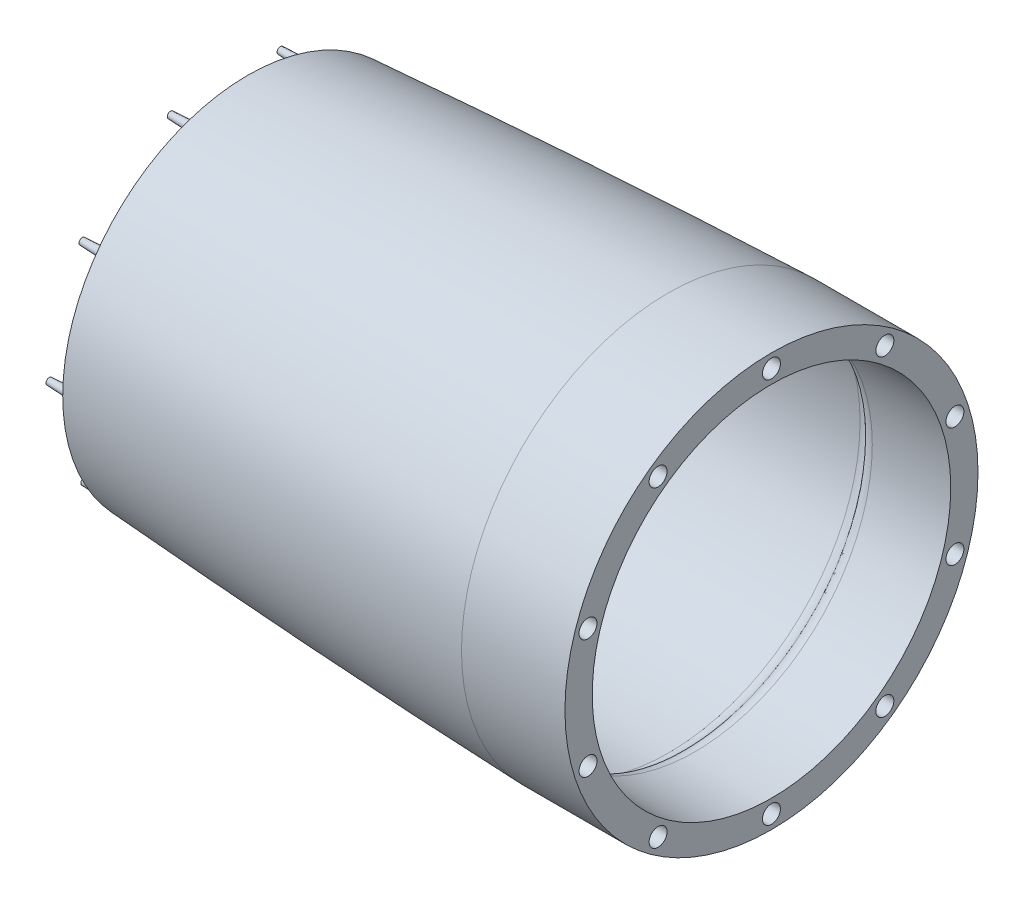
ISO-10303-21;
HEADER;
FILE_DESCRIPTION(('STEP AP214'),'2;1');
FILE_NAME('part.step','',(''),(''),'','','');
FILE_SCHEMA(('AUTOMOTIVE_DESIGN { 1 0 10303 214 1 1 1 1 }'));
ENDSEC;
DATA;
#1=APPLICATION_CONTEXT('core data for automotive mechanical design processes');
#2=APPLICATION_PROTOCOL_DEFINITION('international standard','automotive_design',2000,#1);
#3=PRODUCT_CONTEXT('',#1,'mechanical');
#4=PRODUCT('Part','Part','',(#3));
#5=PRODUCT_RELATED_PRODUCT_CATEGORY('part','',(#4));
#6=PRODUCT_DEFINITION_FORMATION('','',#4);
#7=PRODUCT_DEFINITION_CONTEXT('part definition',#1,'design');
#8=PRODUCT_DEFINITION('design','',#6,#7);
#9=PRODUCT_DEFINITION_SHAPE('','',#8);
#10=(LENGTH_UNIT() NAMED_UNIT(*) SI_UNIT(.MILLI.,.METRE.));
#11=(NAMED_UNIT(*) PLANE_ANGLE_UNIT() SI_UNIT($,.RADIAN.));
#12=(NAMED_UNIT(*) SI_UNIT($,.STERADIAN.) SOLID_ANGLE_UNIT());
#13=UNCERTAINTY_MEASURE_WITH_UNIT(LENGTH_MEASURE(1.E-05),#10,'distance_accuracy_value','');
#14=(GEOMETRIC_REPRESENTATION_CONTEXT(3) GLOBAL_UNCERTAINTY_ASSIGNED_CONTEXT((#13)) GLOBAL_UNIT_ASSIGNED_CONTEXT((#10,
#11,#12)) REPRESENTATION_CONTEXT('',''));
#15=CARTESIAN_POINT('',(0.,0.,0.));
#16=DIRECTION('',(0.,0.,1.));
#17=DIRECTION('',(1.,0.,0.));
#18=AXIS2_PLACEMENT_3D('',#15,#16,#17);
#19=CARTESIAN_POINT('',(0.,-76.2,0.));
#20=DIRECTION('',(1.,0.,0.));
#21=DIRECTION('',(0.,0.,-1.));
#22=AXIS2_PLACEMENT_3D('',#19,#20,#21);
#23=CYLINDRICAL_SURFACE('',#22,87.6605702842971);
#24=CARTESIAN_POINT('',(-259.812483714893,-76.2,0.));
#25=DIRECTION('',(1.,0.,0.));
#26=DIRECTION('',(0.,0.,-1.));
#27=AXIS2_PLACEMENT_3D('',#24,#25,#26);
#28=CIRCLE('',#27,87.6605702842971);
#29=CARTESIAN_POINT('',(-259.812483714893,-76.2,-87.6605702842971));
#30=VERTEX_POINT('',#29);
#31=EDGE_CURVE('E70',#30,#30,#28,.T.);
#32=ORIENTED_EDGE('',*,*,#31,.T.);
#33=EDGE_LOOP('',(#32));
#34=FACE_BOUND('',#33,.T.);
#35=CARTESIAN_POINT('',(-215.9,-76.2,0.));
#36=DIRECTION('',(1.,0.,0.));
#37=DIRECTION('',(0.,0.,-1.));
#38=AXIS2_PLACEMENT_3D('',#35,#36,#37);
#39=CIRCLE('',#38,87.6605702842971);
#40=CARTESIAN_POINT('',(-215.9,-76.2,-87.6605702842971));
#41=VERTEX_POINT('',#40);
#42=EDGE_CURVE('E79',#41,#41,#39,.T.);
#43=ORIENTED_EDGE('',*,*,#42,.F.);
#44=EDGE_LOOP('',(#43));
#45=FACE_BOUND('',#44,.T.);
#46=ADVANCED_FACE('F33',(#34,#45),#23,.T.);
#47=CARTESIAN_POINT('',(0.,0.,0.));
#48=CARTESIAN_POINT('',(-50.8,0.,0.));
#49=CARTESIAN_POINT('',(-101.6,0.,0.));
#50=CARTESIAN_POINT('',(-157.18237532759,0.,0.));
#51=CARTESIAN_POINT('',(-166.74712598277,0.,0.));
#52=CARTESIAN_POINT('',(-181.09425196554,0.,0.));
#53=CARTESIAN_POINT('',(-190.65900262072,0.,0.));
#54=CARTESIAN_POINT('',(-199.585120864969,0.,0.));
#55=CARTESIAN_POINT('',(-207.872606698287,0.,0.));
#56=CARTESIAN_POINT('',(-220.304800851467,-0.15495983877073,0.));
#57=CARTESIAN_POINT('',(-228.589711976257,-0.361524820706449,0.));
#58=CARTESIAN_POINT('',(-235.094659098791,-0.523710541786571,0.));
#59=CARTESIAN_POINT('',(-239.819642219067,-0.641517002011094,0.));
#60=CARTESIAN_POINT('',(-245.046645358789,-0.791480258471811,0.));
#61=CARTESIAN_POINT('',(-247.911294959409,-0.876040976098197,0.));
#62=CARTESIAN_POINT('',(-248.413737761523,-0.890953220604229,0.));
#63=B_SPLINE_CURVE_WITH_KNOTS('',3,(#47,#48,#49,#50,#51,#52,#53,#54,#55,#56,#57,#58,#59,#60,#61,
#62),.UNSPECIFIED.,.F.,.F.,(4,2,1,1,2,1,1,2,1,1,4),(0.761574076780111,0.907841521459126,
0.921611321039098,0.93538112061907,0.949150920199042,0.961081917990901,0.97301291578276,
0.98494391357462,0.991748303184292,0.998552692793965,1.),.UNSPECIFIED.);
#64=CARTESIAN_POINT('',(0.,-76.2,0.));
#65=DIRECTION('',(1.,0.,0.));
#66=AXIS1_PLACEMENT('',#64,#65);
#67=SURFACE_OF_REVOLUTION('',#63,#66);
#68=CARTESIAN_POINT('',(-248.413737761523,-76.2,0.));
#69=DIRECTION('',(1.,0.,0.));
#70=DIRECTION('',(0.,0.,-1.));
#71=AXIS2_PLACEMENT_3D('',#68,#69,#70);
#72=CIRCLE('',#71,75.3090467793958);
#73=CARTESIAN_POINT('',(-248.413737761523,-76.2,-75.3090467793958));
#74=VERTEX_POINT('',#73);
#75=EDGE_CURVE('E88',#74,#74,#72,.T.);
#76=ORIENTED_EDGE('',*,*,#75,.F.);
#77=EDGE_LOOP('',(#76));
#78=FACE_BOUND('',#77,.T.);
#79=CARTESIAN_POINT('',(-215.9,-76.2,0.));
#80=DIRECTION('',(1.,0.,0.));
#81=DIRECTION('',(0.,0.,-1.));
#82=AXIS2_PLACEMENT_3D('',#79,#80,#81);
#83=CIRCLE('',#82,76.091842302558);
#84=CARTESIAN_POINT('',(-215.9,-76.2,-76.091842302558));
#85=VERTEX_POINT('',#84);
#86=EDGE_CURVE('E76',#85,#85,#83,.F.);
#87=ORIENTED_EDGE('',*,*,#86,.F.);
#88=EDGE_LOOP('',(#87));
#89=FACE_BOUND('',#88,.T.);
#90=ADVANCED_FACE('F103',(#78,#89),#67,.T.);
#91=CARTESIAN_POINT('',(-259.812483714893,11.460570284297,0.));
#92=CARTESIAN_POINT('',(-287.312106379697,10.5623408515305,0.));
#93=CARTESIAN_POINT('',(-342.298022137353,8.17156900853598,0.));
#94=CARTESIAN_POINT('',(-452.140135715747,1.83352473554385,0.));
#95=CARTESIAN_POINT('',(-589.280273051557,-8.5121188078909,0.));
#96=CARTESIAN_POINT('',(-726.176632388446,-21.7709007537404,0.));
#97=CARTESIAN_POINT('',(-835.465785428388,-34.5887261399924,0.));
#98=CARTESIAN_POINT('',(-890.027026606975,-41.9652027624198,0.));
#99=CARTESIAN_POINT('',(-917.245364412614,-46.0396236215406,0.));
#100=B_SPLINE_CURVE_WITH_KNOTS('',3,(#91,#92,#93,#94,#95,#96,#97,#98,#99),.UNSPECIFIED.,.F.,.F.,
(4,1,1,1,1,1,4),(0.121539177885851,0.200323508121493,0.279107838357135,0.436676498828419,
0.594245159299703,0.673029489535345,0.751813819770986),.UNSPECIFIED.);
#101=CARTESIAN_POINT('',(0.,-76.2,0.));
#102=DIRECTION('',(1.,0.,0.));
#103=AXIS1_PLACEMENT('',#101,#102);
#104=SURFACE_OF_REVOLUTION('',#100,#103);
#105=CARTESIAN_POINT('',(-438.15,-76.2,0.));
#106=DIRECTION('',(1.,0.,0.));
#107=DIRECTION('',(0.,0.,-1.));
#108=AXIS2_PLACEMENT_3D('',#105,#106,#107);
#109=CIRCLE('',#108,78.5859575802931);
#110=CARTESIAN_POINT('',(-438.15,-76.2,-78.5859575802931));
#111=VERTEX_POINT('',#110);
#112=EDGE_CURVE('E74',#111,#111,#109,.F.);
#113=ORIENTED_EDGE('',*,*,#112,.F.);
#114=EDGE_LOOP('',(#113));
#115=FACE_BOUND('',#114,.T.);
#116=ORIENTED_EDGE('',*,*,#31,.F.);
#117=EDGE_LOOP('',(#116));
#118=FACE_BOUND('',#117,.T.);
#119=ADVANCED_FACE('F107',(#115,#118),#104,.F.);
#120=CARTESIAN_POINT('',(-259.605182082093,5.11395496327444,0.));
#121=CARTESIAN_POINT('',(-267.12768254606,4.86824499819252,0.));
#122=CARTESIAN_POINT('',(-283.426031509972,4.28566928092725,0.));
#123=CARTESIAN_POINT('',(-317.270262328934,2.88050564552106,0.));
#124=CARTESIAN_POINT('',(-361.130016616179,0.711244662128463,0.));
#125=CARTESIAN_POINT('',(-431.275457268552,-3.37195649395594,0.));
#126=CARTESIAN_POINT('',(-501.372917975129,-8.26687627302136,0.));
#127=CARTESIAN_POINT('',(-571.414486842692,-13.8916826479783,0.));
#128=CARTESIAN_POINT('',(-623.914744737059,-18.4776988889442,0.));
#129=CARTESIAN_POINT('',(-676.380314026956,-23.4393497952148,0.));
#130=CARTESIAN_POINT('',(-728.805663240347,-28.7990620723279,0.));
#131=CARTESIAN_POINT('',(-772.453634614019,-33.627485173269,0.));
#132=CARTESIAN_POINT('',(-807.341816529924,-37.7391545432386,0.));
#133=CARTESIAN_POINT('',(-833.490683910714,-40.9589001471484,0.));
#134=CARTESIAN_POINT('',(-859.619375691871,-44.3289411148186,0.));
#135=CARTESIAN_POINT('',(-885.723877264818,-47.8693351323976,0.));
#136=CARTESIAN_POINT('',(-904.61249297492,-50.577906922154,0.));
#137=CARTESIAN_POINT('',(-914.800968172167,-52.0944643953555,0.));
#138=CARTESIAN_POINT('',(-916.305282206307,-52.3196511250938,0.));
#139=B_SPLINE_CURVE_WITH_KNOTS('',3,(#120,#121,#122,#123,#124,#125,#126,#127,#128,#129,#130,
#131,#132,#133,#134,#135,#136,#137,#138),.UNSPECIFIED.,.F.,.F.,(4,1,1,1,1,1,1,1,1,1,1,1,1,1,1,1,
4),(0.121539177885851,0.143122913317239,0.168303261053087,0.218663956524784,0.26902465199648,
0.369746042939873,0.420106738411569,0.470467433883266,0.520828129354962,0.571188824826659,
0.621549520298355,0.646729868034203,0.671910215770052,0.6970905635059,0.722270911241748,
0.747451258977596,0.751813819770986),.UNSPECIFIED.);
#140=CARTESIAN_POINT('',(0.,-76.2,0.));
#141=DIRECTION('',(1.,0.,0.));
#142=AXIS1_PLACEMENT('',#140,#141);
#143=SURFACE_OF_REVOLUTION('',#139,#142);
#144=CARTESIAN_POINT('',(-438.15,-76.2,0.));
#145=DIRECTION('',(1.,0.,0.));
#146=DIRECTION('',(0.,0.,-1.));
#147=AXIS2_PLACEMENT_3D('',#144,#145,#146);
#148=CIRCLE('',#147,72.2219194807445);
#149=CARTESIAN_POINT('',(-438.15,-76.2,-72.2219194807445));
#150=VERTEX_POINT('',#149);
#151=EDGE_CURVE('E71',#150,#150,#148,.F.);
#152=ORIENTED_EDGE('',*,*,#151,.T.);
#153=EDGE_LOOP('',(#152));
#154=FACE_BOUND('',#153,.T.);
#155=CARTESIAN_POINT('',(-259.605182082093,-76.2,0.));
#156=DIRECTION('',(1.,0.,0.));
#157=DIRECTION('',(0.,0.,-1.));
#158=AXIS2_PLACEMENT_3D('',#155,#156,#157);
#159=CIRCLE('',#158,81.3139549632744);
#160=CARTESIAN_POINT('',(-259.605182082093,-76.2,-81.3139549632744));
#161=VERTEX_POINT('',#160);
#162=EDGE_CURVE('E82',#161,#161,#159,.T.);
#163=ORIENTED_EDGE('',*,*,#162,.T.);
#164=EDGE_LOOP('',(#163));
#165=FACE_BOUND('',#164,.T.);
#166=ADVANCED_FACE('F118',(#154,#165),#143,.T.);
#167=CARTESIAN_POINT('',(-259.397880449279,-76.2,0.));
#168=DIRECTION('',(1.,0.,0.));
#169=DIRECTION('',(0.,0.,-1.));
#170=AXIS2_PLACEMENT_3D('',#167,#168,#169);
#171=TOROIDAL_SURFACE('',#170,74.9673396422523,6.35000000000002);
#172=ORIENTED_EDGE('',*,*,#162,.F.);
#173=EDGE_LOOP('',(#172));
#174=FACE_BOUND('',#173,.T.);
#175=CARTESIAN_POINT('',(-254.,-76.2,0.));
#176=DIRECTION('',(1.,0.,0.));
#177=DIRECTION('',(0.,0.,-1.));
#178=AXIS2_PLACEMENT_3D('',#175,#176,#177);
#179=CIRCLE('',#178,78.3117957497969);
#180=CARTESIAN_POINT('',(-254.,-76.2,-78.3117957497969));
#181=VERTEX_POINT('',#180);
#182=EDGE_CURVE('E85',#181,#181,#179,.T.);
#183=ORIENTED_EDGE('',*,*,#182,.T.);
#184=EDGE_LOOP('',(#183));
#185=FACE_BOUND('',#184,.T.);
#186=ADVANCED_FACE('F114',(#174,#185),#171,.F.);
#187=CARTESIAN_POINT('',(-248.602119550721,-76.2,0.));
#188=DIRECTION('',(1.,0.,0.));
#189=DIRECTION('',(0.,0.,-1.));
#190=AXIS2_PLACEMENT_3D('',#187,#188,#189);
#191=TOROIDAL_SURFACE('',#190,81.6562518573414,6.34999999999995);
#192=ORIENTED_EDGE('',*,*,#75,.T.);
#193=EDGE_LOOP('',(#192));
#194=FACE_BOUND('',#193,.T.);
#195=ORIENTED_EDGE('',*,*,#182,.F.);
#196=EDGE_LOOP('',(#195));
#197=FACE_BOUND('',#196,.T.);
#198=ADVANCED_FACE('F111',(#194,#197),#191,.T.);
#199=CARTESIAN_POINT('',(-215.9,0.,0.));
#200=DIRECTION('',(1.,0.,0.));
#201=DIRECTION('',(0.,0.,-1.));
#202=AXIS2_PLACEMENT_3D('',#199,#200,#201);
#203=PLANE('',#202);
#204=CARTESIAN_POINT('',(-215.9,5.67620631329702,0.));
#205=DIRECTION('',(1.,0.,0.));
#206=DIRECTION('',(0.,0.,-1.));
#207=AXIS2_PLACEMENT_3D('',#204,#205,#206);
#208=CIRCLE('',#207,3.81);
#209=CARTESIAN_POINT('',(-215.9,5.67620631329702,-3.81));
#210=VERTEX_POINT('',#209);
#211=EDGE_CURVE('E184',#210,#210,#208,.T.);
#212=ORIENTED_EDGE('',*,*,#211,.F.);
#213=EDGE_LOOP('',(#212));
#214=FACE_BOUND('',#213,.T.);
#215=CARTESIAN_POINT('',(-215.9,-9.96075765759751,48.1256265846095));
#216=DIRECTION('',(1.,0.,0.));
#217=DIRECTION('',(0.,0.,-1.));
#218=AXIS2_PLACEMENT_3D('',#215,#216,#217);
#219=CIRCLE('',#218,3.81);
#220=CARTESIAN_POINT('',(-215.9,-9.96075765759751,44.3156265846095));
#221=VERTEX_POINT('',#220);
#222=EDGE_CURVE('E185',#221,#221,#219,.T.);
#223=ORIENTED_EDGE('',*,*,#222,.F.);
#224=EDGE_LOOP('',(#223));
#225=FACE_BOUND('',#224,.T.);
#226=CARTESIAN_POINT('',(-215.9,-50.8988608142487,77.8688995437817));
#227=DIRECTION('',(1.,0.,0.));
#228=DIRECTION('',(0.,0.,-1.));
#229=AXIS2_PLACEMENT_3D('',#226,#227,#228);
#230=CIRCLE('',#229,3.81);
#231=CARTESIAN_POINT('',(-215.9,-50.8988608142487,74.0588995437816));
#232=VERTEX_POINT('',#231);
#233=EDGE_CURVE('E135',#232,#232,#230,.T.);
#234=ORIENTED_EDGE('',*,*,#233,.F.);
#235=EDGE_LOOP('',(#234));
#236=FACE_BOUND('',#235,.T.);
#237=CARTESIAN_POINT('',(-215.9,-101.501139185765,77.8688995437771));
#238=DIRECTION('',(1.,0.,0.));
#239=DIRECTION('',(0.,0.,-1.));
#240=AXIS2_PLACEMENT_3D('',#237,#238,#239);
#241=CIRCLE('',#240,3.80999999999999);
#242=CARTESIAN_POINT('',(-215.9,-101.501139185765,74.0588995437771));
#243=VERTEX_POINT('',#242);
#244=EDGE_CURVE('E142',#243,#243,#241,.T.);
#245=ORIENTED_EDGE('',*,*,#244,.F.);
#246=EDGE_LOOP('',(#245));
#247=FACE_BOUND('',#246,.T.);
#248=CARTESIAN_POINT('',(-215.9,-142.439242342411,48.1256265845978));
#249=DIRECTION('',(1.,0.,0.));
#250=DIRECTION('',(0.,0.,-1.));
#251=AXIS2_PLACEMENT_3D('',#248,#249,#250);
#252=CIRCLE('',#251,3.80999999999999);
#253=CARTESIAN_POINT('',(-215.9,-142.439242342411,44.3156265845978));
#254=VERTEX_POINT('',#253);
#255=EDGE_CURVE('E148',#254,#254,#252,.T.);
#256=ORIENTED_EDGE('',*,*,#255,.F.);
#257=EDGE_LOOP('',(#256));
#258=FACE_BOUND('',#257,.T.);
#259=CARTESIAN_POINT('',(-215.9,-158.076206313297,-1.56876128926297E-11));
#260=DIRECTION('',(1.,0.,0.));
#261=DIRECTION('',(0.,0.,-1.));
#262=AXIS2_PLACEMENT_3D('',#259,#260,#261);
#263=CIRCLE('',#262,3.81);
#264=CARTESIAN_POINT('',(-215.9,-158.076206313297,-3.81000000001569));
#265=VERTEX_POINT('',#264);
#266=EDGE_CURVE('E154',#265,#265,#263,.T.);
#267=ORIENTED_EDGE('',*,*,#266,.F.);
#268=EDGE_LOOP('',(#267));
#269=FACE_BOUND('',#268,.T.);
#270=CARTESIAN_POINT('',(-215.9,-142.439242342402,-48.1256265846262));
#271=DIRECTION('',(1.,0.,0.));
#272=DIRECTION('',(0.,0.,-1.));
#273=AXIS2_PLACEMENT_3D('',#270,#271,#272);
#274=CIRCLE('',#273,3.81000000000001);
#275=CARTESIAN_POINT('',(-215.9,-142.439242342402,-51.9356265846263));
#276=VERTEX_POINT('',#275);
#277=EDGE_CURVE('E160',#276,#276,#274,.T.);
#278=ORIENTED_EDGE('',*,*,#277,.F.);
#279=EDGE_LOOP('',(#278));
#280=FACE_BOUND('',#279,.T.);
#281=CARTESIAN_POINT('',(-215.9,-101.501139185751,-77.8688995437981));
#282=DIRECTION('',(1.,0.,0.));
#283=DIRECTION('',(0.,0.,-1.));
#284=AXIS2_PLACEMENT_3D('',#281,#282,#283);
#285=CIRCLE('',#284,3.81000000000001);
#286=CARTESIAN_POINT('',(-215.9,-101.501139185751,-81.6788995437981));
#287=VERTEX_POINT('',#286);
#288=EDGE_CURVE('E166',#287,#287,#285,.T.);
#289=ORIENTED_EDGE('',*,*,#288,.F.);
#290=EDGE_LOOP('',(#289));
#291=FACE_BOUND('',#290,.T.);
#292=CARTESIAN_POINT('',(-215.9,-50.8988608142344,-77.8688995437933));
#293=DIRECTION('',(1.,0.,0.));
#294=DIRECTION('',(0.,0.,-1.));
#295=AXIS2_PLACEMENT_3D('',#292,#293,#294);
#296=CIRCLE('',#295,3.81);
#297=CARTESIAN_POINT('',(-215.9,-50.8988608142344,-81.6788995437933));
#298=VERTEX_POINT('',#297);
#299=EDGE_CURVE('E172',#298,#298,#296,.T.);
#300=ORIENTED_EDGE('',*,*,#299,.F.);
#301=EDGE_LOOP('',(#300));
#302=FACE_BOUND('',#301,.T.);
#303=CARTESIAN_POINT('',(-215.9,-9.96075765758863,-48.1256265846135));
#304=DIRECTION('',(1.,0.,0.));
#305=DIRECTION('',(0.,0.,-1.));
#306=AXIS2_PLACEMENT_3D('',#303,#304,#305);
#307=CIRCLE('',#306,3.81);
#308=CARTESIAN_POINT('',(-215.9,-9.96075765758863,-51.9356265846136));
#309=VERTEX_POINT('',#308);
#310=EDGE_CURVE('E178',#309,#309,#307,.T.);
#311=ORIENTED_EDGE('',*,*,#310,.F.);
#312=EDGE_LOOP('',(#311));
#313=FACE_BOUND('',#312,.T.);
#314=ORIENTED_EDGE('',*,*,#86,.T.);
#315=EDGE_LOOP('',(#314));
#316=FACE_BOUND('',#315,.T.);
#317=ORIENTED_EDGE('',*,*,#42,.T.);
#318=EDGE_LOOP('',(#317));
#319=FACE_BOUND('',#318,.T.);
#320=ADVANCED_FACE('F109',(#214,#225,#236,#247,#258,#269,#280,#291,#302,#313,#316,#319),#203,.T.);
#321=CARTESIAN_POINT('',(-438.15,-76.2,0.));
#322=DIRECTION('',(1.,0.,0.));
#323=DIRECTION('',(0.,0.,-1.));
#324=AXIS2_PLACEMENT_3D('',#321,#322,#323);
#325=PLANE('',#324);
#326=CARTESIAN_POINT('',(-438.15,-4.28598565713471,-22.6744016257329));
#327=DIRECTION('',(1.,0.,0.));
#328=DIRECTION('',(0.,0.,-1.));
#329=AXIS2_PLACEMENT_3D('',#326,#327,#328);
#330=CIRCLE('',#329,1.778);
#331=CARTESIAN_POINT('',(-438.15,-4.28598565713471,-24.4524016257329));
#332=VERTEX_POINT('',#331);
#333=EDGE_CURVE('E10',#332,#332,#330,.F.);
#334=ORIENTED_EDGE('',*,*,#333,.F.);
#335=EDGE_LOOP('',(#334));
#336=FACE_BOUND('',#335,.T.);
#337=CARTESIAN_POINT('',(-438.15,-31.3480191430651,-60.6139733163867));
#338=DIRECTION('',(1.,0.,0.));
#339=DIRECTION('',(0.,0.,-1.));
#340=AXIS2_PLACEMENT_3D('',#337,#338,#339);
#341=CIRCLE('',#340,1.778);
#342=CARTESIAN_POINT('',(-438.15,-31.3480191430651,-62.3919733163867));
#343=VERTEX_POINT('',#342);
#344=EDGE_CURVE('E39',#343,#343,#341,.F.);
#345=ORIENTED_EDGE('',*,*,#344,.F.);
#346=EDGE_LOOP('',(#345));
#347=FACE_BOUND('',#346,.T.);
#348=CARTESIAN_POINT('',(-438.15,-75.541984853586,-75.4010673933572));
#349=DIRECTION('',(1.,0.,0.));
#350=DIRECTION('',(0.,0.,-1.));
#351=AXIS2_PLACEMENT_3D('',#348,#349,#350);
#352=CIRCLE('',#351,1.778);
#353=CARTESIAN_POINT('',(-438.15,-75.541984853586,-77.1790673933572));
#354=VERTEX_POINT('',#353);
#355=EDGE_CURVE('E43',#354,#354,#352,.F.);
#356=ORIENTED_EDGE('',*,*,#355,.F.);
#357=EDGE_LOOP('',(#356));
#358=FACE_BOUND('',#357,.T.);
#359=CARTESIAN_POINT('',(-438.15,-119.987289984926,-61.3875165140841));
#360=DIRECTION('',(1.,0.,0.));
#361=DIRECTION('',(0.,0.,-1.));
#362=AXIS2_PLACEMENT_3D('',#359,#360,#361);
#363=CIRCLE('',#362,1.778);
#364=CARTESIAN_POINT('',(-438.15,-119.987289984926,-63.1655165140841));
#365=VERTEX_POINT('',#364);
#366=EDGE_CURVE('E47',#365,#365,#363,.F.);
#367=ORIENTED_EDGE('',*,*,#366,.F.);
#368=EDGE_LOOP('',(#367));
#369=FACE_BOUND('',#368,.T.);
#370=CARTESIAN_POINT('',(-438.15,-147.707338617273,-23.9260208113737));
#371=DIRECTION('',(1.,0.,0.));
#372=DIRECTION('',(0.,0.,-1.));
#373=AXIS2_PLACEMENT_3D('',#370,#371,#372);
#374=CIRCLE('',#373,1.778);
#375=CARTESIAN_POINT('',(-438.15,-147.707338617273,-25.7040208113737));
#376=VERTEX_POINT('',#375);
#377=EDGE_CURVE('E52',#376,#376,#374,.F.);
#378=ORIENTED_EDGE('',*,*,#377,.F.);
#379=EDGE_LOOP('',(#378));
#380=FACE_BOUND('',#379,.T.);
#381=CARTESIAN_POINT('',(-438.15,-148.114014342871,22.6744016257468));
#382=DIRECTION('',(1.,0.,0.));
#383=DIRECTION('',(0.,0.,-1.));
#384=AXIS2_PLACEMENT_3D('',#381,#382,#383);
#385=CIRCLE('',#384,1.778);
#386=CARTESIAN_POINT('',(-438.15,-148.114014342871,20.8964016257468));
#387=VERTEX_POINT('',#386);
#388=EDGE_CURVE('E55',#387,#387,#385,.F.);
#389=ORIENTED_EDGE('',*,*,#388,.F.);
#390=EDGE_LOOP('',(#389));
#391=FACE_BOUND('',#390,.T.);
#392=CARTESIAN_POINT('',(-438.15,-121.05198085694,60.6139733164006));
#393=DIRECTION('',(1.,0.,0.));
#394=DIRECTION('',(0.,0.,-1.));
#395=AXIS2_PLACEMENT_3D('',#392,#393,#394);
#396=CIRCLE('',#395,1.778);
#397=CARTESIAN_POINT('',(-438.15,-121.05198085694,58.8359733164006));
#398=VERTEX_POINT('',#397);
#399=EDGE_CURVE('E58',#398,#398,#396,.F.);
#400=ORIENTED_EDGE('',*,*,#399,.F.);
#401=EDGE_LOOP('',(#400));
#402=FACE_BOUND('',#401,.T.);
#403=CARTESIAN_POINT('',(-438.15,-76.8580151464192,75.4010673933712));
#404=DIRECTION('',(1.,0.,0.));
#405=DIRECTION('',(0.,0.,-1.));
#406=AXIS2_PLACEMENT_3D('',#403,#404,#405);
#407=CIRCLE('',#406,1.778);
#408=CARTESIAN_POINT('',(-438.15,-76.8580151464192,73.6230673933712));
#409=VERTEX_POINT('',#408);
#410=EDGE_CURVE('E61',#409,#409,#407,.F.);
#411=ORIENTED_EDGE('',*,*,#410,.F.);
#412=EDGE_LOOP('',(#411));
#413=FACE_BOUND('',#412,.T.);
#414=CARTESIAN_POINT('',(-438.15,-32.4127100150794,61.3875165140981));
#415=DIRECTION('',(1.,0.,0.));
#416=DIRECTION('',(0.,0.,-1.));
#417=AXIS2_PLACEMENT_3D('',#414,#415,#416);
#418=CIRCLE('',#417,1.77800000000001);
#419=CARTESIAN_POINT('',(-438.15,-32.4127100150794,59.6095165140981));
#420=VERTEX_POINT('',#419);
#421=EDGE_CURVE('E64',#420,#420,#418,.F.);
#422=ORIENTED_EDGE('',*,*,#421,.F.);
#423=EDGE_LOOP('',(#422));
#424=FACE_BOUND('',#423,.T.);
#425=CARTESIAN_POINT('',(-438.15,-4.6926613827324,23.9260208113877));
#426=DIRECTION('',(1.,0.,0.));
#427=DIRECTION('',(0.,0.,-1.));
#428=AXIS2_PLACEMENT_3D('',#425,#426,#427);
#429=CIRCLE('',#428,1.778);
#430=CARTESIAN_POINT('',(-438.15,-4.6926613827324,22.1480208113877));
#431=VERTEX_POINT('',#430);
#432=EDGE_CURVE('E67',#431,#431,#429,.F.);
#433=ORIENTED_EDGE('',*,*,#432,.F.);
#434=EDGE_LOOP('',(#433));
#435=FACE_BOUND('',#434,.T.);
#436=ORIENTED_EDGE('',*,*,#112,.T.);
#437=EDGE_LOOP('',(#436));
#438=FACE_BOUND('',#437,.T.);
#439=ORIENTED_EDGE('',*,*,#151,.F.);
#440=EDGE_LOOP('',(#439));
#441=FACE_BOUND('',#440,.T.);
#442=ADVANCED_FACE('F248',(#336,#347,#358,#369,#380,#391,#402,#413,#424,#435,#438,#441),#325,.F.);
#443=CARTESIAN_POINT('',(-229.87,-9.96075765758863,-48.1256265846135));
#444=DIRECTION('',(1.,0.,0.));
#445=DIRECTION('',(0.,0.,-1.));
#446=AXIS2_PLACEMENT_3D('',#443,#444,#445);
#447=CYLINDRICAL_SURFACE('',#446,3.81);
#448=CARTESIAN_POINT('',(-229.87,-9.96075765758863,-48.1256265846135));
#449=DIRECTION('',(1.,0.,0.));
#450=DIRECTION('',(0.,0.,-1.));
#451=AXIS2_PLACEMENT_3D('',#448,#449,#450);
#452=CIRCLE('',#451,3.81);
#453=CARTESIAN_POINT('',(-229.87,-9.96075765758863,-51.9356265846136));
#454=VERTEX_POINT('',#453);
#455=EDGE_CURVE('E181',#454,#454,#452,.T.);
#456=ORIENTED_EDGE('',*,*,#455,.F.);
#457=EDGE_LOOP('',(#456));
#458=FACE_BOUND('',#457,.T.);
#459=ORIENTED_EDGE('',*,*,#310,.T.);
#460=EDGE_LOOP('',(#459));
#461=FACE_BOUND('',#460,.T.);
#462=ADVANCED_FACE('F253',(#458,#461),#447,.F.);
#463=CARTESIAN_POINT('',(-229.87,-9.96075765758863,-48.1256265846135));
#464=DIRECTION('',(1.,0.,0.));
#465=DIRECTION('',(0.,0.,-1.));
#466=AXIS2_PLACEMENT_3D('',#463,#464,#465);
#467=PLANE('',#466);
#468=ORIENTED_EDGE('',*,*,#455,.T.);
#469=EDGE_LOOP('',(#468));
#470=FACE_BOUND('',#469,.T.);
#471=ADVANCED_FACE('F279',(#470),#467,.T.);
#472=CARTESIAN_POINT('',(-229.87,-50.8988608142344,-77.8688995437933));
#473=DIRECTION('',(1.,0.,0.));
#474=DIRECTION('',(0.,0.,-1.));
#475=AXIS2_PLACEMENT_3D('',#472,#473,#474);
#476=CYLINDRICAL_SURFACE('',#475,3.81);
#477=CARTESIAN_POINT('',(-229.87,-50.8988608142344,-77.8688995437933));
#478=DIRECTION('',(1.,0.,0.));
#479=DIRECTION('',(0.,0.,-1.));
#480=AXIS2_PLACEMENT_3D('',#477,#478,#479);
#481=CIRCLE('',#480,3.81);
#482=CARTESIAN_POINT('',(-229.87,-50.8988608142344,-81.6788995437933));
#483=VERTEX_POINT('',#482);
#484=EDGE_CURVE('E175',#483,#483,#481,.T.);
#485=ORIENTED_EDGE('',*,*,#484,.F.);
#486=EDGE_LOOP('',(#485));
#487=FACE_BOUND('',#486,.T.);
#488=ORIENTED_EDGE('',*,*,#299,.T.);
#489=EDGE_LOOP('',(#488));
#490=FACE_BOUND('',#489,.T.);
#491=ADVANCED_FACE('F285',(#487,#490),#476,.F.);
#492=CARTESIAN_POINT('',(-229.87,-50.8988608142344,-77.8688995437933));
#493=DIRECTION('',(1.,0.,0.));
#494=DIRECTION('',(0.,0.,-1.));
#495=AXIS2_PLACEMENT_3D('',#492,#493,#494);
#496=PLANE('',#495);
#497=ORIENTED_EDGE('',*,*,#484,.T.);
#498=EDGE_LOOP('',(#497));
#499=FACE_BOUND('',#498,.T.);
#500=ADVANCED_FACE('F291',(#499),#496,.T.);
#501=CARTESIAN_POINT('',(-229.87,-101.501139185751,-77.8688995437981));
#502=DIRECTION('',(1.,0.,0.));
#503=DIRECTION('',(0.,0.,-1.));
#504=AXIS2_PLACEMENT_3D('',#501,#502,#503);
#505=CYLINDRICAL_SURFACE('',#504,3.81000000000001);
#506=CARTESIAN_POINT('',(-229.87,-101.501139185751,-77.8688995437981));
#507=DIRECTION('',(1.,0.,0.));
#508=DIRECTION('',(0.,0.,-1.));
#509=AXIS2_PLACEMENT_3D('',#506,#507,#508);
#510=CIRCLE('',#509,3.81000000000001);
#511=CARTESIAN_POINT('',(-229.87,-101.501139185751,-81.6788995437981));
#512=VERTEX_POINT('',#511);
#513=EDGE_CURVE('E169',#512,#512,#510,.T.);
#514=ORIENTED_EDGE('',*,*,#513,.F.);
#515=EDGE_LOOP('',(#514));
#516=FACE_BOUND('',#515,.T.);
#517=ORIENTED_EDGE('',*,*,#288,.T.);
#518=EDGE_LOOP('',(#517));
#519=FACE_BOUND('',#518,.T.);
#520=ADVANCED_FACE('F294',(#516,#519),#505,.F.);
#521=CARTESIAN_POINT('',(-229.87,-101.501139185751,-77.8688995437981));
#522=DIRECTION('',(1.,0.,0.));
#523=DIRECTION('',(0.,0.,-1.));
#524=AXIS2_PLACEMENT_3D('',#521,#522,#523);
#525=PLANE('',#524);
#526=ORIENTED_EDGE('',*,*,#513,.T.);
#527=EDGE_LOOP('',(#526));
#528=FACE_BOUND('',#527,.T.);
#529=ADVANCED_FACE('F299',(#528),#525,.T.);
#530=CARTESIAN_POINT('',(-229.87,-142.439242342402,-48.1256265846262));
#531=DIRECTION('',(1.,0.,0.));
#532=DIRECTION('',(0.,0.,-1.));
#533=AXIS2_PLACEMENT_3D('',#530,#531,#532);
#534=CYLINDRICAL_SURFACE('',#533,3.81000000000001);
#535=CARTESIAN_POINT('',(-229.87,-142.439242342402,-48.1256265846262));
#536=DIRECTION('',(1.,0.,0.));
#537=DIRECTION('',(0.,0.,-1.));
#538=AXIS2_PLACEMENT_3D('',#535,#536,#537);
#539=CIRCLE('',#538,3.81000000000001);
#540=CARTESIAN_POINT('',(-229.87,-142.439242342402,-51.9356265846263));
#541=VERTEX_POINT('',#540);
#542=EDGE_CURVE('E163',#541,#541,#539,.T.);
#543=ORIENTED_EDGE('',*,*,#542,.F.);
#544=EDGE_LOOP('',(#543));
#545=FACE_BOUND('',#544,.T.);
#546=ORIENTED_EDGE('',*,*,#277,.T.);
#547=EDGE_LOOP('',(#546));
#548=FACE_BOUND('',#547,.T.);
#549=ADVANCED_FACE('F302',(#545,#548),#534,.F.);
#550=CARTESIAN_POINT('',(-229.87,-142.439242342402,-48.1256265846262));
#551=DIRECTION('',(1.,0.,0.));
#552=DIRECTION('',(0.,0.,-1.));
#553=AXIS2_PLACEMENT_3D('',#550,#551,#552);
#554=PLANE('',#553);
#555=ORIENTED_EDGE('',*,*,#542,.T.);
#556=EDGE_LOOP('',(#555));
#557=FACE_BOUND('',#556,.T.);
#558=ADVANCED_FACE('F307',(#557),#554,.T.);
#559=CARTESIAN_POINT('',(-229.87,-158.076206313297,-1.56876128926297E-11));
#560=DIRECTION('',(1.,0.,0.));
#561=DIRECTION('',(0.,0.,-1.));
#562=AXIS2_PLACEMENT_3D('',#559,#560,#561);
#563=CYLINDRICAL_SURFACE('',#562,3.81);
#564=CARTESIAN_POINT('',(-229.87,-158.076206313297,-1.56876128926297E-11));
#565=DIRECTION('',(1.,0.,0.));
#566=DIRECTION('',(0.,0.,-1.));
#567=AXIS2_PLACEMENT_3D('',#564,#565,#566);
#568=CIRCLE('',#567,3.81);
#569=CARTESIAN_POINT('',(-229.87,-158.076206313297,-3.81000000001569));
#570=VERTEX_POINT('',#569);
#571=EDGE_CURVE('E157',#570,#570,#568,.T.);
#572=ORIENTED_EDGE('',*,*,#571,.F.);
#573=EDGE_LOOP('',(#572));
#574=FACE_BOUND('',#573,.T.);
#575=ORIENTED_EDGE('',*,*,#266,.T.);
#576=EDGE_LOOP('',(#575));
#577=FACE_BOUND('',#576,.T.);
#578=ADVANCED_FACE('F310',(#574,#577),#563,.F.);
#579=CARTESIAN_POINT('',(-229.87,-158.076206313297,-1.56876128926297E-11));
#580=DIRECTION('',(1.,0.,0.));
#581=DIRECTION('',(0.,0.,-1.));
#582=AXIS2_PLACEMENT_3D('',#579,#580,#581);
#583=PLANE('',#582);
#584=ORIENTED_EDGE('',*,*,#571,.T.);
#585=EDGE_LOOP('',(#584));
#586=FACE_BOUND('',#585,.T.);
#587=ADVANCED_FACE('F315',(#586),#583,.T.);
#588=CARTESIAN_POINT('',(-229.87,-142.439242342411,48.1256265845978));
#589=DIRECTION('',(1.,0.,0.));
#590=DIRECTION('',(0.,0.,-1.));
#591=AXIS2_PLACEMENT_3D('',#588,#589,#590);
#592=CYLINDRICAL_SURFACE('',#591,3.80999999999999);
#593=CARTESIAN_POINT('',(-229.87,-142.439242342411,48.1256265845978));
#594=DIRECTION('',(1.,0.,0.));
#595=DIRECTION('',(0.,0.,-1.));
#596=AXIS2_PLACEMENT_3D('',#593,#594,#595);
#597=CIRCLE('',#596,3.80999999999999);
#598=CARTESIAN_POINT('',(-229.87,-142.439242342411,44.3156265845978));
#599=VERTEX_POINT('',#598);
#600=EDGE_CURVE('E151',#599,#599,#597,.T.);
#601=ORIENTED_EDGE('',*,*,#600,.F.);
#602=EDGE_LOOP('',(#601));
#603=FACE_BOUND('',#602,.T.);
#604=ORIENTED_EDGE('',*,*,#255,.T.);
#605=EDGE_LOOP('',(#604));
#606=FACE_BOUND('',#605,.T.);
#607=ADVANCED_FACE('F318',(#603,#606),#592,.F.);
#608=CARTESIAN_POINT('',(-229.87,-142.439242342411,48.1256265845978));
#609=DIRECTION('',(1.,0.,0.));
#610=DIRECTION('',(0.,0.,-1.));
#611=AXIS2_PLACEMENT_3D('',#608,#609,#610);
#612=PLANE('',#611);
#613=ORIENTED_EDGE('',*,*,#600,.T.);
#614=EDGE_LOOP('',(#613));
#615=FACE_BOUND('',#614,.T.);
#616=ADVANCED_FACE('F323',(#615),#612,.T.);
#617=CARTESIAN_POINT('',(-229.87,-101.501139185765,77.8688995437771));
#618=DIRECTION('',(1.,0.,0.));
#619=DIRECTION('',(0.,0.,-1.));
#620=AXIS2_PLACEMENT_3D('',#617,#618,#619);
#621=CYLINDRICAL_SURFACE('',#620,3.80999999999999);
#622=CARTESIAN_POINT('',(-229.87,-101.501139185765,77.8688995437771));
#623=DIRECTION('',(1.,0.,0.));
#624=DIRECTION('',(0.,0.,-1.));
#625=AXIS2_PLACEMENT_3D('',#622,#623,#624);
#626=CIRCLE('',#625,3.80999999999999);
#627=CARTESIAN_POINT('',(-229.87,-101.501139185765,74.0588995437771));
#628=VERTEX_POINT('',#627);
#629=EDGE_CURVE('E145',#628,#628,#626,.T.);
#630=ORIENTED_EDGE('',*,*,#629,.F.);
#631=EDGE_LOOP('',(#630));
#632=FACE_BOUND('',#631,.T.);
#633=ORIENTED_EDGE('',*,*,#244,.T.);
#634=EDGE_LOOP('',(#633));
#635=FACE_BOUND('',#634,.T.);
#636=ADVANCED_FACE('F326',(#632,#635),#621,.F.);
#637=CARTESIAN_POINT('',(-229.87,-101.501139185765,77.8688995437771));
#638=DIRECTION('',(1.,0.,0.));
#639=DIRECTION('',(0.,0.,-1.));
#640=AXIS2_PLACEMENT_3D('',#637,#638,#639);
#641=PLANE('',#640);
#642=ORIENTED_EDGE('',*,*,#629,.T.);
#643=EDGE_LOOP('',(#642));
#644=FACE_BOUND('',#643,.T.);
#645=ADVANCED_FACE('F331',(#644),#641,.T.);
#646=CARTESIAN_POINT('',(-229.87,-50.8988608142487,77.8688995437817));
#647=DIRECTION('',(1.,0.,0.));
#648=DIRECTION('',(0.,0.,-1.));
#649=AXIS2_PLACEMENT_3D('',#646,#647,#648);
#650=CYLINDRICAL_SURFACE('',#649,3.81);
#651=CARTESIAN_POINT('',(-229.87,-50.8988608142487,77.8688995437817));
#652=DIRECTION('',(1.,0.,0.));
#653=DIRECTION('',(0.,0.,-1.));
#654=AXIS2_PLACEMENT_3D('',#651,#652,#653);
#655=CIRCLE('',#654,3.81);
#656=CARTESIAN_POINT('',(-229.87,-50.8988608142487,74.0588995437816));
#657=VERTEX_POINT('',#656);
#658=EDGE_CURVE('E138',#657,#657,#655,.T.);
#659=ORIENTED_EDGE('',*,*,#658,.F.);
#660=EDGE_LOOP('',(#659));
#661=FACE_BOUND('',#660,.T.);
#662=ORIENTED_EDGE('',*,*,#233,.T.);
#663=EDGE_LOOP('',(#662));
#664=FACE_BOUND('',#663,.T.);
#665=ADVANCED_FACE('F334',(#661,#664),#650,.F.);
#666=CARTESIAN_POINT('',(-229.87,-50.8988608142487,77.8688995437817));
#667=DIRECTION('',(1.,0.,0.));
#668=DIRECTION('',(0.,0.,-1.));
#669=AXIS2_PLACEMENT_3D('',#666,#667,#668);
#670=PLANE('',#669);
#671=ORIENTED_EDGE('',*,*,#658,.T.);
#672=EDGE_LOOP('',(#671));
#673=FACE_BOUND('',#672,.T.);
#674=ADVANCED_FACE('F339',(#673),#670,.T.);
#675=CARTESIAN_POINT('',(-229.87,-9.96075765759751,48.1256265846095));
#676=DIRECTION('',(1.,0.,0.));
#677=DIRECTION('',(0.,0.,-1.));
#678=AXIS2_PLACEMENT_3D('',#675,#676,#677);
#679=CYLINDRICAL_SURFACE('',#678,3.81);
#680=CARTESIAN_POINT('',(-229.87,-9.96075765759751,48.1256265846095));
#681=DIRECTION('',(1.,0.,0.));
#682=DIRECTION('',(0.,0.,-1.));
#683=AXIS2_PLACEMENT_3D('',#680,#681,#682);
#684=CIRCLE('',#683,3.81);
#685=CARTESIAN_POINT('',(-229.87,-9.96075765759751,44.3156265846095));
#686=VERTEX_POINT('',#685);
#687=EDGE_CURVE('E139',#686,#686,#684,.T.);
#688=ORIENTED_EDGE('',*,*,#687,.F.);
#689=EDGE_LOOP('',(#688));
#690=FACE_BOUND('',#689,.T.);
#691=ORIENTED_EDGE('',*,*,#222,.T.);
#692=EDGE_LOOP('',(#691));
#693=FACE_BOUND('',#692,.T.);
#694=ADVANCED_FACE('F342',(#690,#693),#679,.F.);
#695=CARTESIAN_POINT('',(-229.87,-9.96075765759751,48.1256265846095));
#696=DIRECTION('',(1.,0.,0.));
#697=DIRECTION('',(0.,0.,-1.));
#698=AXIS2_PLACEMENT_3D('',#695,#696,#697);
#699=PLANE('',#698);
#700=ORIENTED_EDGE('',*,*,#687,.T.);
#701=EDGE_LOOP('',(#700));
#702=FACE_BOUND('',#701,.T.);
#703=ADVANCED_FACE('F362',(#702),#699,.T.);
#704=CARTESIAN_POINT('',(-229.87,5.67620631329702,0.));
#705=DIRECTION('',(1.,0.,0.));
#706=DIRECTION('',(0.,0.,-1.));
#707=AXIS2_PLACEMENT_3D('',#704,#705,#706);
#708=CYLINDRICAL_SURFACE('',#707,3.81);
#709=CARTESIAN_POINT('',(-229.87,5.67620631329702,0.));
#710=DIRECTION('',(1.,0.,0.));
#711=DIRECTION('',(0.,0.,-1.));
#712=AXIS2_PLACEMENT_3D('',#709,#710,#711);
#713=CIRCLE('',#712,3.81);
#714=CARTESIAN_POINT('',(-229.87,5.67620631329702,-3.81));
#715=VERTEX_POINT('',#714);
#716=EDGE_CURVE('E75',#715,#715,#713,.T.);
#717=ORIENTED_EDGE('',*,*,#716,.F.);
#718=EDGE_LOOP('',(#717));
#719=FACE_BOUND('',#718,.T.);
#720=ORIENTED_EDGE('',*,*,#211,.T.);
#721=EDGE_LOOP('',(#720));
#722=FACE_BOUND('',#721,.T.);
#723=ADVANCED_FACE('F369',(#719,#722),#708,.F.);
#724=CARTESIAN_POINT('',(-229.87,5.67620631329702,0.));
#725=DIRECTION('',(1.,0.,0.));
#726=DIRECTION('',(0.,0.,-1.));
#727=AXIS2_PLACEMENT_3D('',#724,#725,#726);
#728=PLANE('',#727);
#729=ORIENTED_EDGE('',*,*,#716,.T.);
#730=EDGE_LOOP('',(#729));
#731=FACE_BOUND('',#730,.T.);
#732=ADVANCED_FACE('F377',(#731),#728,.T.);
#733=CARTESIAN_POINT('',(-438.15,-4.6926613827324,23.9260208113877));
#734=DIRECTION('',(1.,0.,0.));
#735=DIRECTION('',(0.,0.,1.));
#736=AXIS2_PLACEMENT_3D('',#733,#734,#735);
#737=CONICAL_SURFACE('',#736,1.778,0.0436332312998583);
#738=CARTESIAN_POINT('',(-447.04,-4.6926613827324,23.9260208113877));
#739=DIRECTION('',(-1.,0.,0.));
#740=DIRECTION('',(0.,0.,1.));
#741=AXIS2_PLACEMENT_3D('',#738,#739,#740);
#742=CIRCLE('',#741,1.38985421754333);
#743=CARTESIAN_POINT('',(-447.04,-4.6926613827324,25.315875028931));
#744=VERTEX_POINT('',#743);
#745=EDGE_CURVE('E188',#744,#744,#742,.T.);
#746=ORIENTED_EDGE('',*,*,#745,.F.);
#747=EDGE_LOOP('',(#746));
#748=FACE_BOUND('',#747,.T.);
#749=ORIENTED_EDGE('',*,*,#432,.T.);
#750=EDGE_LOOP('',(#749));
#751=FACE_BOUND('',#750,.T.);
#752=ADVANCED_FACE('F385',(#748,#751),#737,.T.);
#753=CARTESIAN_POINT('',(-447.04,-4.6926613827324,23.9260208113877));
#754=DIRECTION('',(-1.,0.,0.));
#755=DIRECTION('',(0.,0.,1.));
#756=AXIS2_PLACEMENT_3D('',#753,#754,#755);
#757=PLANE('',#756);
#758=ORIENTED_EDGE('',*,*,#745,.T.);
#759=EDGE_LOOP('',(#758));
#760=FACE_BOUND('',#759,.T.);
#761=ADVANCED_FACE('F394',(#760),#757,.T.);
#762=CARTESIAN_POINT('',(-438.15,-32.4127100150794,61.3875165140981));
#763=DIRECTION('',(1.,0.,0.));
#764=DIRECTION('',(0.,0.,1.));
#765=AXIS2_PLACEMENT_3D('',#762,#763,#764);
#766=CONICAL_SURFACE('',#765,1.77800000000001,0.0436332312998583);
#767=CARTESIAN_POINT('',(-447.04,-32.4127100150794,61.3875165140981));
#768=DIRECTION('',(-1.,0.,0.));
#769=DIRECTION('',(0.,0.,1.));
#770=AXIS2_PLACEMENT_3D('',#767,#768,#769);
#771=CIRCLE('',#770,1.38985421754333);
#772=CARTESIAN_POINT('',(-447.04,-32.4127100150794,62.7773707316414));
#773=VERTEX_POINT('',#772);
#774=EDGE_CURVE('E197',#773,#773,#771,.T.);
#775=ORIENTED_EDGE('',*,*,#774,.F.);
#776=EDGE_LOOP('',(#775));
#777=FACE_BOUND('',#776,.T.);
#778=ORIENTED_EDGE('',*,*,#421,.T.);
#779=EDGE_LOOP('',(#778));
#780=FACE_BOUND('',#779,.T.);
#781=ADVANCED_FACE('F402',(#777,#780),#766,.T.);
#782=CARTESIAN_POINT('',(-447.04,-32.4127100150794,61.3875165140981));
#783=DIRECTION('',(-1.,0.,0.));
#784=DIRECTION('',(0.,0.,1.));
#785=AXIS2_PLACEMENT_3D('',#782,#783,#784);
#786=PLANE('',#785);
#787=ORIENTED_EDGE('',*,*,#774,.T.);
#788=EDGE_LOOP('',(#787));
#789=FACE_BOUND('',#788,.T.);
#790=ADVANCED_FACE('F410',(#789),#786,.T.);
#791=CARTESIAN_POINT('',(-438.15,-76.8580151464192,75.4010673933712));
#792=DIRECTION('',(1.,0.,0.));
#793=DIRECTION('',(0.,0.,1.));
#794=AXIS2_PLACEMENT_3D('',#791,#792,#793);
#795=CONICAL_SURFACE('',#794,1.778,0.0436332312998583);
#796=CARTESIAN_POINT('',(-447.04,-76.8580151464192,75.4010673933712));
#797=DIRECTION('',(-1.,0.,0.));
#798=DIRECTION('',(0.,0.,1.));
#799=AXIS2_PLACEMENT_3D('',#796,#797,#798);
#800=CIRCLE('',#799,1.38985421754333);
#801=CARTESIAN_POINT('',(-447.04,-76.8580151464192,76.7909216109145));
#802=VERTEX_POINT('',#801);
#803=EDGE_CURVE('E200',#802,#802,#800,.T.);
#804=ORIENTED_EDGE('',*,*,#803,.F.);
#805=EDGE_LOOP('',(#804));
#806=FACE_BOUND('',#805,.T.);
#807=ORIENTED_EDGE('',*,*,#410,.T.);
#808=EDGE_LOOP('',(#807));
#809=FACE_BOUND('',#808,.T.);
#810=ADVANCED_FACE('F418',(#806,#809),#795,.T.);
#811=CARTESIAN_POINT('',(-447.04,-76.8580151464192,75.4010673933712));
#812=DIRECTION('',(-1.,0.,0.));
#813=DIRECTION('',(0.,0.,1.));
#814=AXIS2_PLACEMENT_3D('',#811,#812,#813);
#815=PLANE('',#814);
#816=ORIENTED_EDGE('',*,*,#803,.T.);
#817=EDGE_LOOP('',(#816));
#818=FACE_BOUND('',#817,.T.);
#819=ADVANCED_FACE('F426',(#818),#815,.T.);
#820=CARTESIAN_POINT('',(-438.15,-121.05198085694,60.6139733164006));
#821=DIRECTION('',(1.,0.,0.));
#822=DIRECTION('',(0.,0.,1.));
#823=AXIS2_PLACEMENT_3D('',#820,#821,#822);
#824=CONICAL_SURFACE('',#823,1.778,0.0436332312998583);
#825=CARTESIAN_POINT('',(-447.04,-121.05198085694,60.6139733164006));
#826=DIRECTION('',(-1.,0.,0.));
#827=DIRECTION('',(0.,0.,1.));
#828=AXIS2_PLACEMENT_3D('',#825,#826,#827);
#829=CIRCLE('',#828,1.38985421754332);
#830=CARTESIAN_POINT('',(-447.04,-121.05198085694,62.0038275339439));
#831=VERTEX_POINT('',#830);
#832=EDGE_CURVE('E203',#831,#831,#829,.T.);
#833=ORIENTED_EDGE('',*,*,#832,.F.);
#834=EDGE_LOOP('',(#833));
#835=FACE_BOUND('',#834,.T.);
#836=ORIENTED_EDGE('',*,*,#399,.T.);
#837=EDGE_LOOP('',(#836));
#838=FACE_BOUND('',#837,.T.);
#839=ADVANCED_FACE('F434',(#835,#838),#824,.T.);
#840=CARTESIAN_POINT('',(-447.04,-121.05198085694,60.6139733164006));
#841=DIRECTION('',(-1.,0.,0.));
#842=DIRECTION('',(0.,0.,1.));
#843=AXIS2_PLACEMENT_3D('',#840,#841,#842);
#844=PLANE('',#843);
#845=ORIENTED_EDGE('',*,*,#832,.T.);
#846=EDGE_LOOP('',(#845));
#847=FACE_BOUND('',#846,.T.);
#848=ADVANCED_FACE('F442',(#847),#844,.T.);
#849=CARTESIAN_POINT('',(-438.15,-148.114014342871,22.6744016257468));
#850=DIRECTION('',(1.,0.,0.));
#851=DIRECTION('',(0.,0.,1.));
#852=AXIS2_PLACEMENT_3D('',#849,#850,#851);
#853=CONICAL_SURFACE('',#852,1.778,0.0436332312998583);
#854=CARTESIAN_POINT('',(-447.04,-148.114014342871,22.6744016257468));
#855=DIRECTION('',(-1.,0.,0.));
#856=DIRECTION('',(0.,0.,1.));
#857=AXIS2_PLACEMENT_3D('',#854,#855,#856);
#858=CIRCLE('',#857,1.38985421754333);
#859=CARTESIAN_POINT('',(-447.04,-148.114014342871,24.0642558432902));
#860=VERTEX_POINT('',#859);
#861=EDGE_CURVE('E206',#860,#860,#858,.T.);
#862=ORIENTED_EDGE('',*,*,#861,.F.);
#863=EDGE_LOOP('',(#862));
#864=FACE_BOUND('',#863,.T.);
#865=ORIENTED_EDGE('',*,*,#388,.T.);
#866=EDGE_LOOP('',(#865));
#867=FACE_BOUND('',#866,.T.);
#868=ADVANCED_FACE('F450',(#864,#867),#853,.T.);
#869=CARTESIAN_POINT('',(-447.04,-148.114014342871,22.6744016257468));
#870=DIRECTION('',(-1.,0.,0.));
#871=DIRECTION('',(0.,0.,1.));
#872=AXIS2_PLACEMENT_3D('',#869,#870,#871);
#873=PLANE('',#872);
#874=ORIENTED_EDGE('',*,*,#861,.T.);
#875=EDGE_LOOP('',(#874));
#876=FACE_BOUND('',#875,.T.);
#877=ADVANCED_FACE('F458',(#876),#873,.T.);
#878=CARTESIAN_POINT('',(-438.15,-147.707338617273,-23.9260208113737));
#879=DIRECTION('',(1.,0.,0.));
#880=DIRECTION('',(0.,0.,1.));
#881=AXIS2_PLACEMENT_3D('',#878,#879,#880);
#882=CONICAL_SURFACE('',#881,1.778,0.0436332312998583);
#883=CARTESIAN_POINT('',(-447.04,-147.707338617273,-23.9260208113737));
#884=DIRECTION('',(-1.,0.,0.));
#885=DIRECTION('',(0.,0.,1.));
#886=AXIS2_PLACEMENT_3D('',#883,#884,#885);
#887=CIRCLE('',#886,1.38985421754332);
#888=CARTESIAN_POINT('',(-447.04,-147.707338617273,-22.5361665938304));
#889=VERTEX_POINT('',#888);
#890=EDGE_CURVE('E209',#889,#889,#887,.T.);
#891=ORIENTED_EDGE('',*,*,#890,.F.);
#892=EDGE_LOOP('',(#891));
#893=FACE_BOUND('',#892,.T.);
#894=ORIENTED_EDGE('',*,*,#377,.T.);
#895=EDGE_LOOP('',(#894));
#896=FACE_BOUND('',#895,.T.);
#897=ADVANCED_FACE('F466',(#893,#896),#882,.T.);
#898=CARTESIAN_POINT('',(-447.04,-147.707338617273,-23.9260208113737));
#899=DIRECTION('',(-1.,0.,0.));
#900=DIRECTION('',(0.,0.,1.));
#901=AXIS2_PLACEMENT_3D('',#898,#899,#900);
#902=PLANE('',#901);
#903=ORIENTED_EDGE('',*,*,#890,.T.);
#904=EDGE_LOOP('',(#903));
#905=FACE_BOUND('',#904,.T.);
#906=ADVANCED_FACE('F474',(#905),#902,.T.);
#907=CARTESIAN_POINT('',(-438.15,-119.987289984926,-61.3875165140841));
#908=DIRECTION('',(1.,0.,0.));
#909=DIRECTION('',(0.,0.,1.));
#910=AXIS2_PLACEMENT_3D('',#907,#908,#909);
#911=CONICAL_SURFACE('',#910,1.778,0.0436332312998583);
#912=CARTESIAN_POINT('',(-447.04,-119.987289984926,-61.3875165140841));
#913=DIRECTION('',(-1.,0.,0.));
#914=DIRECTION('',(0.,0.,1.));
#915=AXIS2_PLACEMENT_3D('',#912,#913,#914);
#916=CIRCLE('',#915,1.38985421754332);
#917=CARTESIAN_POINT('',(-447.04,-119.987289984926,-59.9976622965408));
#918=VERTEX_POINT('',#917);
#919=EDGE_CURVE('E212',#918,#918,#916,.T.);
#920=ORIENTED_EDGE('',*,*,#919,.F.);
#921=EDGE_LOOP('',(#920));
#922=FACE_BOUND('',#921,.T.);
#923=ORIENTED_EDGE('',*,*,#366,.T.);
#924=EDGE_LOOP('',(#923));
#925=FACE_BOUND('',#924,.T.);
#926=ADVANCED_FACE('F482',(#922,#925),#911,.T.);
#927=CARTESIAN_POINT('',(-447.04,-119.987289984926,-61.3875165140841));
#928=DIRECTION('',(-1.,0.,0.));
#929=DIRECTION('',(0.,0.,1.));
#930=AXIS2_PLACEMENT_3D('',#927,#928,#929);
#931=PLANE('',#930);
#932=ORIENTED_EDGE('',*,*,#919,.T.);
#933=EDGE_LOOP('',(#932));
#934=FACE_BOUND('',#933,.T.);
#935=ADVANCED_FACE('F490',(#934),#931,.T.);
#936=CARTESIAN_POINT('',(-438.15,-75.541984853586,-75.4010673933572));
#937=DIRECTION('',(1.,0.,0.));
#938=DIRECTION('',(0.,0.,1.));
#939=AXIS2_PLACEMENT_3D('',#936,#937,#938);
#940=CONICAL_SURFACE('',#939,1.778,0.0436332312998583);
#941=CARTESIAN_POINT('',(-447.04,-75.541984853586,-75.4010673933572));
#942=DIRECTION('',(-1.,0.,0.));
#943=DIRECTION('',(0.,0.,1.));
#944=AXIS2_PLACEMENT_3D('',#941,#942,#943);
#945=CIRCLE('',#944,1.38985421754333);
#946=CARTESIAN_POINT('',(-447.04,-75.541984853586,-74.0112131758139));
#947=VERTEX_POINT('',#946);
#948=EDGE_CURVE('E215',#947,#947,#945,.T.);
#949=ORIENTED_EDGE('',*,*,#948,.F.);
#950=EDGE_LOOP('',(#949));
#951=FACE_BOUND('',#950,.T.);
#952=ORIENTED_EDGE('',*,*,#355,.T.);
#953=EDGE_LOOP('',(#952));
#954=FACE_BOUND('',#953,.T.);
#955=ADVANCED_FACE('F498',(#951,#954),#940,.T.);
#956=CARTESIAN_POINT('',(-447.04,-75.541984853586,-75.4010673933572));
#957=DIRECTION('',(-1.,0.,0.));
#958=DIRECTION('',(0.,0.,1.));
#959=AXIS2_PLACEMENT_3D('',#956,#957,#958);
#960=PLANE('',#959);
#961=ORIENTED_EDGE('',*,*,#948,.T.);
#962=EDGE_LOOP('',(#961));
#963=FACE_BOUND('',#962,.T.);
#964=ADVANCED_FACE('F506',(#963),#960,.T.);
#965=CARTESIAN_POINT('',(-438.15,-31.3480191430651,-60.6139733163867));
#966=DIRECTION('',(1.,0.,0.));
#967=DIRECTION('',(0.,0.,1.));
#968=AXIS2_PLACEMENT_3D('',#965,#966,#967);
#969=CONICAL_SURFACE('',#968,1.778,0.0436332312998583);
#970=CARTESIAN_POINT('',(-447.04,-31.3480191430651,-60.6139733163867));
#971=DIRECTION('',(-1.,0.,0.));
#972=DIRECTION('',(0.,0.,1.));
#973=AXIS2_PLACEMENT_3D('',#970,#971,#972);
#974=CIRCLE('',#973,1.38985421754333);
#975=CARTESIAN_POINT('',(-447.04,-31.3480191430651,-59.2241190988433));
#976=VERTEX_POINT('',#975);
#977=EDGE_CURVE('E218',#976,#976,#974,.T.);
#978=ORIENTED_EDGE('',*,*,#977,.F.);
#979=EDGE_LOOP('',(#978));
#980=FACE_BOUND('',#979,.T.);
#981=ORIENTED_EDGE('',*,*,#344,.T.);
#982=EDGE_LOOP('',(#981));
#983=FACE_BOUND('',#982,.T.);
#984=ADVANCED_FACE('F236',(#980,#983),#969,.T.);
#985=CARTESIAN_POINT('',(-447.04,-31.3480191430651,-60.6139733163867));
#986=DIRECTION('',(-1.,0.,0.));
#987=DIRECTION('',(0.,0.,1.));
#988=AXIS2_PLACEMENT_3D('',#985,#986,#987);
#989=PLANE('',#988);
#990=ORIENTED_EDGE('',*,*,#977,.T.);
#991=EDGE_LOOP('',(#990));
#992=FACE_BOUND('',#991,.T.);
#993=ADVANCED_FACE('F229',(#992),#989,.T.);
#994=CARTESIAN_POINT('',(-438.15,-4.28598565713471,-22.6744016257329));
#995=DIRECTION('',(1.,0.,0.));
#996=DIRECTION('',(0.,0.,1.));
#997=AXIS2_PLACEMENT_3D('',#994,#995,#996);
#998=CONICAL_SURFACE('',#997,1.778,0.0436332312998583);
#999=CARTESIAN_POINT('',(-447.04,-4.28598565713471,-22.6744016257329));
#1000=DIRECTION('',(-1.,0.,0.));
#1001=DIRECTION('',(0.,0.,1.));
#1002=AXIS2_PLACEMENT_3D('',#999,#1000,#1001);
#1003=CIRCLE('',#1002,1.38985421754333);
#1004=CARTESIAN_POINT('',(-447.04,-4.28598565713471,-21.2845474081896));
#1005=VERTEX_POINT('',#1004);
#1006=EDGE_CURVE('E221',#1005,#1005,#1003,.T.);
#1007=ORIENTED_EDGE('',*,*,#1006,.F.);
#1008=EDGE_LOOP('',(#1007));
#1009=FACE_BOUND('',#1008,.T.);
#1010=ORIENTED_EDGE('',*,*,#333,.T.);
#1011=EDGE_LOOP('',(#1010));
#1012=FACE_BOUND('',#1011,.T.);
#1013=ADVANCED_FACE('F227',(#1009,#1012),#998,.T.);
#1014=CARTESIAN_POINT('',(-447.04,-4.28598565713471,-22.6744016257329));
#1015=DIRECTION('',(-1.,0.,0.));
#1016=DIRECTION('',(0.,0.,1.));
#1017=AXIS2_PLACEMENT_3D('',#1014,#1015,#1016);
#1018=PLANE('',#1017);
#1019=ORIENTED_EDGE('',*,*,#1006,.T.);
#1020=EDGE_LOOP('',(#1019));
#1021=FACE_BOUND('',#1020,.T.);
#1022=ADVANCED_FACE('F225',(#1021),#1018,.T.);
#1023=CLOSED_SHELL('',(#46,#90,#119,#166,#186,#198,#320,#442,#462,#471,#491,#500,#520,#529,#549,
#558,#578,#587,#607,#616,#636,#645,#665,#674,#694,#703,#723,#732,#752,#761,#781,#790,#810,#819,
#839,#848,#868,#877,#897,#906,#926,#935,#955,#964,#984,#993,#1013,#1022));
#1024=MANIFOLD_SOLID_BREP('B2',#1023);
#1025=ADVANCED_BREP_SHAPE_REPRESENTATION('',(#18,#1024),#14);
#1026=SHAPE_DEFINITION_REPRESENTATION(#9,#1025);
ENDSEC;
END-ISO-10303-21;
